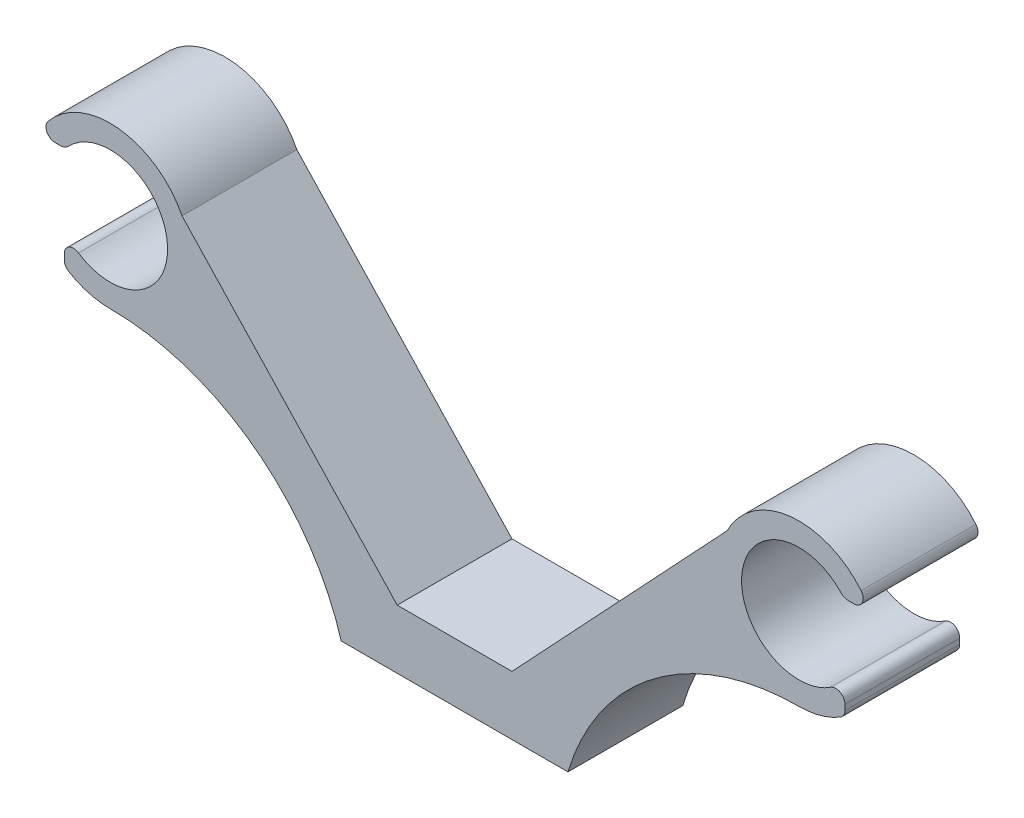
ISO-10303-21;
HEADER;
FILE_DESCRIPTION(('STEP AP214'),'2;1');
FILE_NAME('part.step','',(''),(''),'','','');
FILE_SCHEMA(('AUTOMOTIVE_DESIGN { 1 0 10303 214 1 1 1 1 }'));
ENDSEC;
DATA;
#1=APPLICATION_CONTEXT('core data for automotive mechanical design processes');
#2=APPLICATION_PROTOCOL_DEFINITION('international standard','automotive_design',2000,#1);
#3=PRODUCT_CONTEXT('',#1,'mechanical');
#4=PRODUCT('Part','Part','',(#3));
#5=PRODUCT_RELATED_PRODUCT_CATEGORY('part','',(#4));
#6=PRODUCT_DEFINITION_FORMATION('','',#4);
#7=PRODUCT_DEFINITION_CONTEXT('part definition',#1,'design');
#8=PRODUCT_DEFINITION('design','',#6,#7);
#9=PRODUCT_DEFINITION_SHAPE('','',#8);
#10=(LENGTH_UNIT() NAMED_UNIT(*) SI_UNIT(.MILLI.,.METRE.));
#11=(NAMED_UNIT(*) PLANE_ANGLE_UNIT() SI_UNIT($,.RADIAN.));
#12=(NAMED_UNIT(*) SI_UNIT($,.STERADIAN.) SOLID_ANGLE_UNIT());
#13=UNCERTAINTY_MEASURE_WITH_UNIT(LENGTH_MEASURE(1.E-05),#10,'distance_accuracy_value','');
#14=(GEOMETRIC_REPRESENTATION_CONTEXT(3) GLOBAL_UNCERTAINTY_ASSIGNED_CONTEXT((#13)) GLOBAL_UNIT_ASSIGNED_CONTEXT((#10,
#11,#12)) REPRESENTATION_CONTEXT('',''));
#15=CARTESIAN_POINT('',(0.,0.,0.));
#16=DIRECTION('',(0.,0.,1.));
#17=DIRECTION('',(1.,0.,0.));
#18=AXIS2_PLACEMENT_3D('',#15,#16,#17);
#19=CARTESIAN_POINT('',(-5.,5.14535993764462,10.));
#20=DIRECTION('',(-0.729515847590623,-0.683963908487966,0.));
#21=DIRECTION('',(0.683963908487966,-0.729515847590623,0.));
#22=AXIS2_PLACEMENT_3D('',#19,#20,#21);
#23=PLANE('',#22);
#24=DIRECTION('',(-0.683963908487966,0.729515847590623,0.));
#25=VECTOR('',#24,1.);
#26=CARTESIAN_POINT('',(-5.,5.14535993764462,0.));
#27=LINE('',#26,#25);
#28=CARTESIAN_POINT('',(-5.,5.14535993764462,0.));
#29=VERTEX_POINT('',#28);
#30=CARTESIAN_POINT('',(-23.7410390104122,25.1345505787621,0.));
#31=VERTEX_POINT('',#30);
#32=EDGE_CURVE('E225',#29,#31,#27,.T.);
#33=ORIENTED_EDGE('',*,*,#32,.T.);
#34=DIRECTION('',(0.,0.,-1.));
#35=VECTOR('',#34,1.);
#36=CARTESIAN_POINT('',(-23.7410390104122,25.1345505787621,10.));
#37=LINE('',#36,#35);
#38=CARTESIAN_POINT('',(-23.7410390104122,25.1345505787621,10.));
#39=VERTEX_POINT('',#38);
#40=EDGE_CURVE('E11',#39,#31,#37,.T.);
#41=ORIENTED_EDGE('',*,*,#40,.F.);
#42=DIRECTION('',(-0.683963908487966,0.729515847590623,0.));
#43=VECTOR('',#42,1.);
#44=CARTESIAN_POINT('',(-5.,5.14535993764462,10.));
#45=LINE('',#44,#43);
#46=CARTESIAN_POINT('',(-5.,5.14535993764462,10.));
#47=VERTEX_POINT('',#46);
#48=EDGE_CURVE('E271',#47,#39,#45,.T.);
#49=ORIENTED_EDGE('',*,*,#48,.F.);
#50=DIRECTION('',(0.,0.,-1.));
#51=VECTOR('',#50,1.);
#52=CARTESIAN_POINT('',(-5.,5.14535993764462,10.));
#53=LINE('',#52,#51);
#54=EDGE_CURVE('E221',#47,#29,#53,.T.);
#55=ORIENTED_EDGE('',*,*,#54,.T.);
#56=EDGE_LOOP('',(#33,#41,#49,#55));
#57=FACE_BOUND('',#56,.T.);
#58=ADVANCED_FACE('F33',(#57),#23,.F.);
#59=CARTESIAN_POINT('',(-30.,22.,10.));
#60=DIRECTION('',(0.,0.,-1.));
#61=DIRECTION('',(-1.,0.,0.));
#62=AXIS2_PLACEMENT_3D('',#59,#60,#61);
#63=CYLINDRICAL_SURFACE('',#62,7.);
#64=CARTESIAN_POINT('',(-30.,22.,0.));
#65=DIRECTION('',(0.,0.,1.));
#66=DIRECTION('',(1.,0.,0.));
#67=AXIS2_PLACEMENT_3D('',#64,#65,#66);
#68=CIRCLE('',#67,7.);
#69=CARTESIAN_POINT('',(-35.4098569694725,26.4422345244088,0.));
#70=VERTEX_POINT('',#69);
#71=EDGE_CURVE('E228',#31,#70,#68,.T.);
#72=ORIENTED_EDGE('',*,*,#71,.T.);
#73=DIRECTION('',(0.,0.,-1.));
#74=VECTOR('',#73,1.);
#75=CARTESIAN_POINT('',(-35.4098569694725,26.4422345244088,10.));
#76=LINE('',#75,#74);
#77=CARTESIAN_POINT('',(-35.4098569694725,26.4422345244088,10.));
#78=VERTEX_POINT('',#77);
#79=EDGE_CURVE('E41',#78,#70,#76,.T.);
#80=ORIENTED_EDGE('',*,*,#79,.F.);
#81=CARTESIAN_POINT('',(-30.,22.,10.));
#82=DIRECTION('',(0.,0.,1.));
#83=DIRECTION('',(1.,0.,0.));
#84=AXIS2_PLACEMENT_3D('',#81,#82,#83);
#85=CIRCLE('',#84,7.);
#86=EDGE_CURVE('E140',#39,#78,#85,.T.);
#87=ORIENTED_EDGE('',*,*,#86,.F.);
#88=ORIENTED_EDGE('',*,*,#40,.T.);
#89=EDGE_LOOP('',(#72,#80,#87,#88));
#90=FACE_BOUND('',#89,.T.);
#91=ADVANCED_FACE('F409',(#90),#63,.T.);
#92=CARTESIAN_POINT('',(-34.7915876015328,25.9345505787621,10.));
#93=DIRECTION('',(0.,0.,-1.));
#94=DIRECTION('',(-1.,0.,0.));
#95=AXIS2_PLACEMENT_3D('',#92,#93,#94);
#96=CYLINDRICAL_SURFACE('',#95,0.800000000000001);
#97=CARTESIAN_POINT('',(-34.7915876015328,25.9345505787621,0.));
#98=DIRECTION('',(0.,0.,1.));
#99=DIRECTION('',(-1.,0.,0.));
#100=AXIS2_PLACEMENT_3D('',#97,#98,#99);
#101=CIRCLE('',#100,0.800000000000001);
#102=CARTESIAN_POINT('',(-34.7915876015328,25.1345505787621,0.));
#103=VERTEX_POINT('',#102);
#104=EDGE_CURVE('E230',#70,#103,#101,.T.);
#105=ORIENTED_EDGE('',*,*,#104,.T.);
#106=DIRECTION('',(0.,0.,-1.));
#107=VECTOR('',#106,1.);
#108=CARTESIAN_POINT('',(-34.7915876015328,25.1345505787621,10.));
#109=LINE('',#108,#107);
#110=CARTESIAN_POINT('',(-34.7915876015328,25.1345505787621,10.));
#111=VERTEX_POINT('',#110);
#112=EDGE_CURVE('E326',#111,#103,#109,.T.);
#113=ORIENTED_EDGE('',*,*,#112,.F.);
#114=CARTESIAN_POINT('',(-34.7915876015328,25.9345505787621,10.));
#115=DIRECTION('',(0.,0.,1.));
#116=DIRECTION('',(-1.,0.,0.));
#117=AXIS2_PLACEMENT_3D('',#114,#115,#116);
#118=CIRCLE('',#117,0.800000000000001);
#119=EDGE_CURVE('E334',#78,#111,#118,.T.);
#120=ORIENTED_EDGE('',*,*,#119,.F.);
#121=ORIENTED_EDGE('',*,*,#79,.T.);
#122=EDGE_LOOP('',(#105,#113,#120,#121));
#123=FACE_BOUND('',#122,.T.);
#124=ADVANCED_FACE('F332',(#123),#96,.T.);
#125=CARTESIAN_POINT('',(-34.3480445618298,25.1345505787621,10.));
#126=DIRECTION('',(0.,1.,0.));
#127=DIRECTION('',(-1.,0.,0.));
#128=AXIS2_PLACEMENT_3D('',#125,#126,#127);
#129=PLANE('',#128);
#130=DIRECTION('',(1.,0.,0.));
#131=VECTOR('',#130,1.);
#132=CARTESIAN_POINT('',(-34.3480445618298,25.1345505787621,0.));
#133=LINE('',#132,#131);
#134=CARTESIAN_POINT('',(-34.3480445618298,25.1345505787621,0.));
#135=VERTEX_POINT('',#134);
#136=EDGE_CURVE('E232',#103,#135,#133,.T.);
#137=ORIENTED_EDGE('',*,*,#136,.T.);
#138=DIRECTION('',(0.,0.,-1.));
#139=VECTOR('',#138,1.);
#140=CARTESIAN_POINT('',(-34.3480445618298,25.1345505787621,10.));
#141=LINE('',#140,#139);
#142=CARTESIAN_POINT('',(-34.3480445618298,25.1345505787621,10.));
#143=VERTEX_POINT('',#142);
#144=EDGE_CURVE('E323',#143,#135,#141,.T.);
#145=ORIENTED_EDGE('',*,*,#144,.F.);
#146=DIRECTION('',(1.,0.,0.));
#147=VECTOR('',#146,1.);
#148=CARTESIAN_POINT('',(-34.3480445618298,25.1345505787621,10.));
#149=LINE('',#148,#147);
#150=EDGE_CURVE('E352',#111,#143,#149,.T.);
#151=ORIENTED_EDGE('',*,*,#150,.F.);
#152=ORIENTED_EDGE('',*,*,#112,.T.);
#153=EDGE_LOOP('',(#137,#145,#151,#152));
#154=FACE_BOUND('',#153,.T.);
#155=ADVANCED_FACE('F343',(#154),#129,.F.);
#156=CARTESIAN_POINT('',(-34.3480445618298,26.1345505787621,10.));
#157=DIRECTION('',(0.,0.,-1.));
#158=DIRECTION('',(-1.,0.,0.));
#159=AXIS2_PLACEMENT_3D('',#156,#157,#158);
#160=CYLINDRICAL_SURFACE('',#159,1.);
#161=CARTESIAN_POINT('',(-34.3480445618298,26.1345505787621,0.));
#162=DIRECTION('',(0.,0.,1.));
#163=DIRECTION('',(1.,0.,0.));
#164=AXIS2_PLACEMENT_3D('',#161,#162,#163);
#165=CIRCLE('',#164,1.);
#166=CARTESIAN_POINT('',(-33.6233704681915,25.4454588156351,0.));
#167=VERTEX_POINT('',#166);
#168=EDGE_CURVE('E234',#135,#167,#165,.T.);
#169=ORIENTED_EDGE('',*,*,#168,.T.);
#170=DIRECTION('',(0.,0.,-1.));
#171=VECTOR('',#170,1.);
#172=CARTESIAN_POINT('',(-33.6233704681915,25.4454588156351,10.));
#173=LINE('',#172,#171);
#174=CARTESIAN_POINT('',(-33.6233704681915,25.4454588156351,10.));
#175=VERTEX_POINT('',#174);
#176=EDGE_CURVE('E320',#175,#167,#173,.T.);
#177=ORIENTED_EDGE('',*,*,#176,.F.);
#178=CARTESIAN_POINT('',(-34.3480445618298,26.1345505787621,10.));
#179=DIRECTION('',(0.,0.,1.));
#180=DIRECTION('',(1.,0.,0.));
#181=AXIS2_PLACEMENT_3D('',#178,#179,#180);
#182=CIRCLE('',#181,1.);
#183=EDGE_CURVE('E349',#143,#175,#182,.T.);
#184=ORIENTED_EDGE('',*,*,#183,.F.);
#185=ORIENTED_EDGE('',*,*,#144,.T.);
#186=EDGE_LOOP('',(#169,#177,#184,#185));
#187=FACE_BOUND('',#186,.T.);
#188=ADVANCED_FACE('F347',(#187),#160,.T.);
#189=CARTESIAN_POINT('',(-30.,22.,10.));
#190=DIRECTION('',(0.,0.,-1.));
#191=DIRECTION('',(-1.,0.,0.));
#192=AXIS2_PLACEMENT_3D('',#189,#190,#191);
#193=CYLINDRICAL_SURFACE('',#192,5.);
#194=CARTESIAN_POINT('',(-30.,22.,0.));
#195=DIRECTION('',(0.,0.,-1.));
#196=DIRECTION('',(1.,0.,0.));
#197=AXIS2_PLACEMENT_3D('',#194,#195,#196);
#198=CIRCLE('',#197,5.);
#199=CARTESIAN_POINT('',(-32.7586206896552,17.8298666819145,0.));
#200=VERTEX_POINT('',#199);
#201=EDGE_CURVE('E236',#167,#200,#198,.T.);
#202=ORIENTED_EDGE('',*,*,#201,.T.);
#203=DIRECTION('',(0.,0.,-1.));
#204=VECTOR('',#203,1.);
#205=CARTESIAN_POINT('',(-32.7586206896552,17.8298666819145,10.));
#206=LINE('',#205,#204);
#207=CARTESIAN_POINT('',(-32.7586206896552,17.8298666819145,10.));
#208=VERTEX_POINT('',#207);
#209=EDGE_CURVE('E317',#208,#200,#206,.T.);
#210=ORIENTED_EDGE('',*,*,#209,.F.);
#211=CARTESIAN_POINT('',(-30.,22.,10.));
#212=DIRECTION('',(0.,0.,-1.));
#213=DIRECTION('',(1.,0.,0.));
#214=AXIS2_PLACEMENT_3D('',#211,#212,#213);
#215=CIRCLE('',#214,5.);
#216=EDGE_CURVE('E351',#175,#208,#215,.T.);
#217=ORIENTED_EDGE('',*,*,#216,.F.);
#218=ORIENTED_EDGE('',*,*,#176,.T.);
#219=EDGE_LOOP('',(#202,#210,#217,#218));
#220=FACE_BOUND('',#219,.T.);
#221=ADVANCED_FACE('F422',(#220),#193,.F.);
#222=CARTESIAN_POINT('',(-33.2,17.1626453510209,10.));
#223=DIRECTION('',(0.,0.,-1.));
#224=DIRECTION('',(-1.,0.,0.));
#225=AXIS2_PLACEMENT_3D('',#222,#223,#224);
#226=CYLINDRICAL_SURFACE('',#225,0.8);
#227=CARTESIAN_POINT('',(-33.2,17.1626453510209,0.));
#228=DIRECTION('',(0.,0.,1.));
#229=DIRECTION('',(-1.,0.,0.));
#230=AXIS2_PLACEMENT_3D('',#227,#228,#229);
#231=CIRCLE('',#230,0.8);
#232=CARTESIAN_POINT('',(-34.,17.1626453510209,0.));
#233=VERTEX_POINT('',#232);
#234=EDGE_CURVE('E238',#200,#233,#231,.T.);
#235=ORIENTED_EDGE('',*,*,#234,.T.);
#236=DIRECTION('',(0.,0.,-1.));
#237=VECTOR('',#236,1.);
#238=CARTESIAN_POINT('',(-34.,17.1626453510209,10.));
#239=LINE('',#238,#237);
#240=CARTESIAN_POINT('',(-34.,17.1626453510209,10.));
#241=VERTEX_POINT('',#240);
#242=EDGE_CURVE('E314',#241,#233,#239,.T.);
#243=ORIENTED_EDGE('',*,*,#242,.F.);
#244=CARTESIAN_POINT('',(-33.2,17.1626453510209,10.));
#245=DIRECTION('',(0.,0.,1.));
#246=DIRECTION('',(-1.,0.,0.));
#247=AXIS2_PLACEMENT_3D('',#244,#245,#246);
#248=CIRCLE('',#247,0.8);
#249=EDGE_CURVE('E354',#208,#241,#248,.T.);
#250=ORIENTED_EDGE('',*,*,#249,.F.);
#251=ORIENTED_EDGE('',*,*,#209,.T.);
#252=EDGE_LOOP('',(#235,#243,#250,#251));
#253=FACE_BOUND('',#252,.T.);
#254=ADVANCED_FACE('F425',(#253),#226,.T.);
#255=CARTESIAN_POINT('',(-34.,16.6896327810593,10.));
#256=DIRECTION('',(1.,0.,0.));
#257=DIRECTION('',(0.,0.,-1.));
#258=AXIS2_PLACEMENT_3D('',#255,#256,#257);
#259=PLANE('',#258);
#260=DIRECTION('',(0.,-1.,0.));
#261=VECTOR('',#260,1.);
#262=CARTESIAN_POINT('',(-34.,16.6896327810593,0.));
#263=LINE('',#262,#261);
#264=CARTESIAN_POINT('',(-34.,16.6896327810593,0.));
#265=VERTEX_POINT('',#264);
#266=EDGE_CURVE('E240',#233,#265,#263,.T.);
#267=ORIENTED_EDGE('',*,*,#266,.T.);
#268=DIRECTION('',(0.,0.,-1.));
#269=VECTOR('',#268,1.);
#270=CARTESIAN_POINT('',(-34.,16.6896327810593,10.));
#271=LINE('',#270,#269);
#272=CARTESIAN_POINT('',(-34.,16.6896327810593,10.));
#273=VERTEX_POINT('',#272);
#274=EDGE_CURVE('E311',#273,#265,#271,.T.);
#275=ORIENTED_EDGE('',*,*,#274,.F.);
#276=DIRECTION('',(0.,-1.,0.));
#277=VECTOR('',#276,1.);
#278=CARTESIAN_POINT('',(-34.,16.6896327810593,10.));
#279=LINE('',#278,#277);
#280=EDGE_CURVE('E360',#241,#273,#279,.T.);
#281=ORIENTED_EDGE('',*,*,#280,.F.);
#282=ORIENTED_EDGE('',*,*,#242,.T.);
#283=EDGE_LOOP('',(#267,#275,#281,#282));
#284=FACE_BOUND('',#283,.T.);
#285=ADVANCED_FACE('F429',(#284),#259,.F.);
#286=CARTESIAN_POINT('',(-33.2,16.6896327810593,10.));
#287=DIRECTION('',(0.,0.,-1.));
#288=DIRECTION('',(-1.,0.,0.));
#289=AXIS2_PLACEMENT_3D('',#286,#287,#288);
#290=CYLINDRICAL_SURFACE('',#289,0.800000000000003);
#291=CARTESIAN_POINT('',(-33.2,16.6896327810593,0.));
#292=DIRECTION('',(0.,0.,1.));
#293=DIRECTION('',(1.,0.,0.));
#294=AXIS2_PLACEMENT_3D('',#291,#292,#293);
#295=CIRCLE('',#294,0.800000000000003);
#296=CARTESIAN_POINT('',(-33.6129032258065,16.0044241076476,0.));
#297=VERTEX_POINT('',#296);
#298=EDGE_CURVE('E242',#265,#297,#295,.T.);
#299=ORIENTED_EDGE('',*,*,#298,.T.);
#300=DIRECTION('',(0.,0.,-1.));
#301=VECTOR('',#300,1.);
#302=CARTESIAN_POINT('',(-33.6129032258065,16.0044241076476,10.));
#303=LINE('',#302,#301);
#304=CARTESIAN_POINT('',(-33.6129032258065,16.0044241076476,10.));
#305=VERTEX_POINT('',#304);
#306=EDGE_CURVE('E308',#305,#297,#303,.T.);
#307=ORIENTED_EDGE('',*,*,#306,.F.);
#308=CARTESIAN_POINT('',(-33.2,16.6896327810593,10.));
#309=DIRECTION('',(0.,0.,1.));
#310=DIRECTION('',(1.,0.,0.));
#311=AXIS2_PLACEMENT_3D('',#308,#309,#310);
#312=CIRCLE('',#311,0.800000000000003);
#313=EDGE_CURVE('E362',#273,#305,#312,.T.);
#314=ORIENTED_EDGE('',*,*,#313,.F.);
#315=ORIENTED_EDGE('',*,*,#274,.T.);
#316=EDGE_LOOP('',(#299,#307,#314,#315));
#317=FACE_BOUND('',#316,.T.);
#318=ADVANCED_FACE('F433',(#317),#290,.T.);
#319=CARTESIAN_POINT('',(-30.,22.,10.));
#320=DIRECTION('',(0.,0.,-1.));
#321=DIRECTION('',(-1.,0.,0.));
#322=AXIS2_PLACEMENT_3D('',#319,#320,#321);
#323=CYLINDRICAL_SURFACE('',#322,7.);
#324=CARTESIAN_POINT('',(-30.,22.,0.));
#325=DIRECTION('',(0.,0.,1.));
#326=DIRECTION('',(1.,0.,0.));
#327=AXIS2_PLACEMENT_3D('',#324,#325,#326);
#328=CIRCLE('',#327,7.);
#329=CARTESIAN_POINT('',(-30.,15.,0.));
#330=VERTEX_POINT('',#329);
#331=EDGE_CURVE('E244',#297,#330,#328,.T.);
#332=ORIENTED_EDGE('',*,*,#331,.T.);
#333=DIRECTION('',(0.,0.,-1.));
#334=VECTOR('',#333,1.);
#335=CARTESIAN_POINT('',(-30.,15.,10.));
#336=LINE('',#335,#334);
#337=CARTESIAN_POINT('',(-30.,15.,10.));
#338=VERTEX_POINT('',#337);
#339=EDGE_CURVE('E305',#338,#330,#336,.T.);
#340=ORIENTED_EDGE('',*,*,#339,.F.);
#341=CARTESIAN_POINT('',(-30.,22.,10.));
#342=DIRECTION('',(0.,0.,1.));
#343=DIRECTION('',(1.,0.,0.));
#344=AXIS2_PLACEMENT_3D('',#341,#342,#343);
#345=CIRCLE('',#344,7.);
#346=EDGE_CURVE('E364',#305,#338,#345,.T.);
#347=ORIENTED_EDGE('',*,*,#346,.F.);
#348=ORIENTED_EDGE('',*,*,#306,.T.);
#349=EDGE_LOOP('',(#332,#340,#347,#348));
#350=FACE_BOUND('',#349,.T.);
#351=ADVANCED_FACE('F437',(#350),#323,.T.);
#352=CARTESIAN_POINT('',(-30.,-6.,10.));
#353=DIRECTION('',(0.,0.,-1.));
#354=DIRECTION('',(-1.,0.,0.));
#355=AXIS2_PLACEMENT_3D('',#352,#353,#354);
#356=CYLINDRICAL_SURFACE('',#355,21.);
#357=CARTESIAN_POINT('',(-30.,-6.,0.));
#358=DIRECTION('',(0.,0.,-1.));
#359=DIRECTION('',(1.,0.,0.));
#360=AXIS2_PLACEMENT_3D('',#357,#358,#359);
#361=CIRCLE('',#360,21.);
#362=CARTESIAN_POINT('',(-9.87538820250189,0.,0.));
#363=VERTEX_POINT('',#362);
#364=EDGE_CURVE('E246',#330,#363,#361,.T.);
#365=ORIENTED_EDGE('',*,*,#364,.T.);
#366=DIRECTION('',(0.,0.,-1.));
#367=VECTOR('',#366,1.);
#368=CARTESIAN_POINT('',(-9.87538820250189,0.,10.));
#369=LINE('',#368,#367);
#370=CARTESIAN_POINT('',(-9.87538820250189,0.,10.));
#371=VERTEX_POINT('',#370);
#372=EDGE_CURVE('E302',#371,#363,#369,.T.);
#373=ORIENTED_EDGE('',*,*,#372,.F.);
#374=CARTESIAN_POINT('',(-30.,-6.,10.));
#375=DIRECTION('',(0.,0.,-1.));
#376=DIRECTION('',(1.,0.,0.));
#377=AXIS2_PLACEMENT_3D('',#374,#375,#376);
#378=CIRCLE('',#377,21.);
#379=EDGE_CURVE('E366',#338,#371,#378,.T.);
#380=ORIENTED_EDGE('',*,*,#379,.F.);
#381=ORIENTED_EDGE('',*,*,#339,.T.);
#382=EDGE_LOOP('',(#365,#373,#380,#381));
#383=FACE_BOUND('',#382,.T.);
#384=ADVANCED_FACE('F441',(#383),#356,.F.);
#385=CARTESIAN_POINT('',(9.87538820250189,0.,10.));
#386=DIRECTION('',(0.,1.,0.));
#387=DIRECTION('',(0.,0.,1.));
#388=AXIS2_PLACEMENT_3D('',#385,#386,#387);
#389=PLANE('',#388);
#390=DIRECTION('',(1.,0.,0.));
#391=VECTOR('',#390,1.);
#392=CARTESIAN_POINT('',(9.87538820250189,0.,0.));
#393=LINE('',#392,#391);
#394=CARTESIAN_POINT('',(9.87538820250189,0.,0.));
#395=VERTEX_POINT('',#394);
#396=EDGE_CURVE('E248',#363,#395,#393,.T.);
#397=ORIENTED_EDGE('',*,*,#396,.T.);
#398=DIRECTION('',(0.,0.,-1.));
#399=VECTOR('',#398,1.);
#400=CARTESIAN_POINT('',(9.87538820250189,0.,10.));
#401=LINE('',#400,#399);
#402=CARTESIAN_POINT('',(9.87538820250189,0.,10.));
#403=VERTEX_POINT('',#402);
#404=EDGE_CURVE('E299',#403,#395,#401,.T.);
#405=ORIENTED_EDGE('',*,*,#404,.F.);
#406=DIRECTION('',(1.,0.,0.));
#407=VECTOR('',#406,1.);
#408=CARTESIAN_POINT('',(9.87538820250189,0.,10.));
#409=LINE('',#408,#407);
#410=EDGE_CURVE('E368',#371,#403,#409,.T.);
#411=ORIENTED_EDGE('',*,*,#410,.F.);
#412=ORIENTED_EDGE('',*,*,#372,.T.);
#413=EDGE_LOOP('',(#397,#405,#411,#412));
#414=FACE_BOUND('',#413,.T.);
#415=ADVANCED_FACE('F445',(#414),#389,.F.);
#416=CARTESIAN_POINT('',(30.,-6.,10.));
#417=DIRECTION('',(0.,0.,-1.));
#418=DIRECTION('',(-1.,0.,0.));
#419=AXIS2_PLACEMENT_3D('',#416,#417,#418);
#420=CYLINDRICAL_SURFACE('',#419,21.);
#421=CARTESIAN_POINT('',(30.,-6.,0.));
#422=DIRECTION('',(0.,0.,-1.));
#423=DIRECTION('',(-1.,0.,0.));
#424=AXIS2_PLACEMENT_3D('',#421,#422,#423);
#425=CIRCLE('',#424,21.);
#426=CARTESIAN_POINT('',(30.,15.,0.));
#427=VERTEX_POINT('',#426);
#428=EDGE_CURVE('E250',#395,#427,#425,.T.);
#429=ORIENTED_EDGE('',*,*,#428,.T.);
#430=DIRECTION('',(0.,0.,-1.));
#431=VECTOR('',#430,1.);
#432=CARTESIAN_POINT('',(30.,15.,10.));
#433=LINE('',#432,#431);
#434=CARTESIAN_POINT('',(30.,15.,10.));
#435=VERTEX_POINT('',#434);
#436=EDGE_CURVE('E296',#435,#427,#433,.T.);
#437=ORIENTED_EDGE('',*,*,#436,.F.);
#438=CARTESIAN_POINT('',(30.,-6.,10.));
#439=DIRECTION('',(0.,0.,-1.));
#440=DIRECTION('',(-1.,0.,0.));
#441=AXIS2_PLACEMENT_3D('',#438,#439,#440);
#442=CIRCLE('',#441,21.);
#443=EDGE_CURVE('E370',#403,#435,#442,.T.);
#444=ORIENTED_EDGE('',*,*,#443,.F.);
#445=ORIENTED_EDGE('',*,*,#404,.T.);
#446=EDGE_LOOP('',(#429,#437,#444,#445));
#447=FACE_BOUND('',#446,.T.);
#448=ADVANCED_FACE('F449',(#447),#420,.F.);
#449=CARTESIAN_POINT('',(30.,22.,10.));
#450=DIRECTION('',(0.,0.,-1.));
#451=DIRECTION('',(-1.,0.,0.));
#452=AXIS2_PLACEMENT_3D('',#449,#450,#451);
#453=CYLINDRICAL_SURFACE('',#452,7.);
#454=CARTESIAN_POINT('',(30.,22.,0.));
#455=DIRECTION('',(0.,0.,1.));
#456=DIRECTION('',(-1.,0.,0.));
#457=AXIS2_PLACEMENT_3D('',#454,#455,#456);
#458=CIRCLE('',#457,7.);
#459=CARTESIAN_POINT('',(33.6129032258065,16.0044241076476,0.));
#460=VERTEX_POINT('',#459);
#461=EDGE_CURVE('E252',#427,#460,#458,.T.);
#462=ORIENTED_EDGE('',*,*,#461,.T.);
#463=DIRECTION('',(0.,0.,-1.));
#464=VECTOR('',#463,1.);
#465=CARTESIAN_POINT('',(33.6129032258065,16.0044241076476,10.));
#466=LINE('',#465,#464);
#467=CARTESIAN_POINT('',(33.6129032258065,16.0044241076476,10.));
#468=VERTEX_POINT('',#467);
#469=EDGE_CURVE('E293',#468,#460,#466,.T.);
#470=ORIENTED_EDGE('',*,*,#469,.F.);
#471=CARTESIAN_POINT('',(30.,22.,10.));
#472=DIRECTION('',(0.,0.,1.));
#473=DIRECTION('',(-1.,0.,0.));
#474=AXIS2_PLACEMENT_3D('',#471,#472,#473);
#475=CIRCLE('',#474,7.);
#476=EDGE_CURVE('E372',#435,#468,#475,.T.);
#477=ORIENTED_EDGE('',*,*,#476,.F.);
#478=ORIENTED_EDGE('',*,*,#436,.T.);
#479=EDGE_LOOP('',(#462,#470,#477,#478));
#480=FACE_BOUND('',#479,.T.);
#481=ADVANCED_FACE('F453',(#480),#453,.T.);
#482=CARTESIAN_POINT('',(33.2,16.6896327810593,10.));
#483=DIRECTION('',(0.,0.,-1.));
#484=DIRECTION('',(-1.,0.,0.));
#485=AXIS2_PLACEMENT_3D('',#482,#483,#484);
#486=CYLINDRICAL_SURFACE('',#485,0.800000000000003);
#487=CARTESIAN_POINT('',(33.2,16.6896327810593,0.));
#488=DIRECTION('',(0.,0.,1.));
#489=DIRECTION('',(-1.,0.,0.));
#490=AXIS2_PLACEMENT_3D('',#487,#488,#489);
#491=CIRCLE('',#490,0.800000000000003);
#492=CARTESIAN_POINT('',(34.,16.6896327810593,0.));
#493=VERTEX_POINT('',#492);
#494=EDGE_CURVE('E254',#460,#493,#491,.T.);
#495=ORIENTED_EDGE('',*,*,#494,.T.);
#496=DIRECTION('',(0.,0.,-1.));
#497=VECTOR('',#496,1.);
#498=CARTESIAN_POINT('',(34.,16.6896327810593,10.));
#499=LINE('',#498,#497);
#500=CARTESIAN_POINT('',(34.,16.6896327810593,10.));
#501=VERTEX_POINT('',#500);
#502=EDGE_CURVE('E290',#501,#493,#499,.T.);
#503=ORIENTED_EDGE('',*,*,#502,.F.);
#504=CARTESIAN_POINT('',(33.2,16.6896327810593,10.));
#505=DIRECTION('',(0.,0.,1.));
#506=DIRECTION('',(-1.,0.,0.));
#507=AXIS2_PLACEMENT_3D('',#504,#505,#506);
#508=CIRCLE('',#507,0.800000000000003);
#509=EDGE_CURVE('E374',#468,#501,#508,.T.);
#510=ORIENTED_EDGE('',*,*,#509,.F.);
#511=ORIENTED_EDGE('',*,*,#469,.T.);
#512=EDGE_LOOP('',(#495,#503,#510,#511));
#513=FACE_BOUND('',#512,.T.);
#514=ADVANCED_FACE('F457',(#513),#486,.T.);
#515=CARTESIAN_POINT('',(34.,16.6896327810593,10.));
#516=DIRECTION('',(-1.,0.,0.));
#517=DIRECTION('',(0.,0.,1.));
#518=AXIS2_PLACEMENT_3D('',#515,#516,#517);
#519=PLANE('',#518);
#520=DIRECTION('',(0.,1.,0.));
#521=VECTOR('',#520,1.);
#522=CARTESIAN_POINT('',(34.,16.6896327810593,0.));
#523=LINE('',#522,#521);
#524=CARTESIAN_POINT('',(34.,17.1626453510209,0.));
#525=VERTEX_POINT('',#524);
#526=EDGE_CURVE('E256',#493,#525,#523,.T.);
#527=ORIENTED_EDGE('',*,*,#526,.T.);
#528=DIRECTION('',(0.,0.,-1.));
#529=VECTOR('',#528,1.);
#530=CARTESIAN_POINT('',(34.,17.1626453510209,10.));
#531=LINE('',#530,#529);
#532=CARTESIAN_POINT('',(34.,17.1626453510209,10.));
#533=VERTEX_POINT('',#532);
#534=EDGE_CURVE('E287',#533,#525,#531,.T.);
#535=ORIENTED_EDGE('',*,*,#534,.F.);
#536=DIRECTION('',(0.,1.,0.));
#537=VECTOR('',#536,1.);
#538=CARTESIAN_POINT('',(34.,16.6896327810593,10.));
#539=LINE('',#538,#537);
#540=EDGE_CURVE('E376',#501,#533,#539,.T.);
#541=ORIENTED_EDGE('',*,*,#540,.F.);
#542=ORIENTED_EDGE('',*,*,#502,.T.);
#543=EDGE_LOOP('',(#527,#535,#541,#542));
#544=FACE_BOUND('',#543,.T.);
#545=ADVANCED_FACE('F461',(#544),#519,.F.);
#546=CARTESIAN_POINT('',(33.2,17.1626453510209,10.));
#547=DIRECTION('',(0.,0.,-1.));
#548=DIRECTION('',(-1.,0.,0.));
#549=AXIS2_PLACEMENT_3D('',#546,#547,#548);
#550=CYLINDRICAL_SURFACE('',#549,0.8);
#551=CARTESIAN_POINT('',(33.2,17.1626453510209,0.));
#552=DIRECTION('',(0.,0.,1.));
#553=DIRECTION('',(1.,0.,0.));
#554=AXIS2_PLACEMENT_3D('',#551,#552,#553);
#555=CIRCLE('',#554,0.8);
#556=CARTESIAN_POINT('',(32.7586206896552,17.8298666819145,0.));
#557=VERTEX_POINT('',#556);
#558=EDGE_CURVE('E258',#525,#557,#555,.T.);
#559=ORIENTED_EDGE('',*,*,#558,.T.);
#560=DIRECTION('',(0.,0.,-1.));
#561=VECTOR('',#560,1.);
#562=CARTESIAN_POINT('',(32.7586206896552,17.8298666819145,10.));
#563=LINE('',#562,#561);
#564=CARTESIAN_POINT('',(32.7586206896552,17.8298666819145,10.));
#565=VERTEX_POINT('',#564);
#566=EDGE_CURVE('E284',#565,#557,#563,.T.);
#567=ORIENTED_EDGE('',*,*,#566,.F.);
#568=CARTESIAN_POINT('',(33.2,17.1626453510209,10.));
#569=DIRECTION('',(0.,0.,1.));
#570=DIRECTION('',(1.,0.,0.));
#571=AXIS2_PLACEMENT_3D('',#568,#569,#570);
#572=CIRCLE('',#571,0.8);
#573=EDGE_CURVE('E378',#533,#565,#572,.T.);
#574=ORIENTED_EDGE('',*,*,#573,.F.);
#575=ORIENTED_EDGE('',*,*,#534,.T.);
#576=EDGE_LOOP('',(#559,#567,#574,#575));
#577=FACE_BOUND('',#576,.T.);
#578=ADVANCED_FACE('F465',(#577),#550,.T.);
#579=CARTESIAN_POINT('',(30.,22.,10.));
#580=DIRECTION('',(0.,0.,-1.));
#581=DIRECTION('',(-1.,0.,0.));
#582=AXIS2_PLACEMENT_3D('',#579,#580,#581);
#583=CYLINDRICAL_SURFACE('',#582,5.);
#584=CARTESIAN_POINT('',(30.,22.,0.));
#585=DIRECTION('',(0.,0.,-1.));
#586=DIRECTION('',(-1.,0.,0.));
#587=AXIS2_PLACEMENT_3D('',#584,#585,#586);
#588=CIRCLE('',#587,5.);
#589=CARTESIAN_POINT('',(33.6233704681915,25.4454588156351,0.));
#590=VERTEX_POINT('',#589);
#591=EDGE_CURVE('E260',#557,#590,#588,.T.);
#592=ORIENTED_EDGE('',*,*,#591,.T.);
#593=DIRECTION('',(0.,0.,-1.));
#594=VECTOR('',#593,1.);
#595=CARTESIAN_POINT('',(33.6233704681915,25.4454588156351,10.));
#596=LINE('',#595,#594);
#597=CARTESIAN_POINT('',(33.6233704681915,25.4454588156351,10.));
#598=VERTEX_POINT('',#597);
#599=EDGE_CURVE('E281',#598,#590,#596,.T.);
#600=ORIENTED_EDGE('',*,*,#599,.F.);
#601=CARTESIAN_POINT('',(30.,22.,10.));
#602=DIRECTION('',(0.,0.,-1.));
#603=DIRECTION('',(-1.,0.,0.));
#604=AXIS2_PLACEMENT_3D('',#601,#602,#603);
#605=CIRCLE('',#604,5.);
#606=EDGE_CURVE('E380',#565,#598,#605,.T.);
#607=ORIENTED_EDGE('',*,*,#606,.F.);
#608=ORIENTED_EDGE('',*,*,#566,.T.);
#609=EDGE_LOOP('',(#592,#600,#607,#608));
#610=FACE_BOUND('',#609,.T.);
#611=ADVANCED_FACE('F469',(#610),#583,.F.);
#612=CARTESIAN_POINT('',(34.3480445618298,26.1345505787621,10.));
#613=DIRECTION('',(0.,0.,-1.));
#614=DIRECTION('',(-1.,0.,0.));
#615=AXIS2_PLACEMENT_3D('',#612,#613,#614);
#616=CYLINDRICAL_SURFACE('',#615,1.);
#617=CARTESIAN_POINT('',(34.3480445618298,26.1345505787621,0.));
#618=DIRECTION('',(0.,0.,1.));
#619=DIRECTION('',(-1.,0.,0.));
#620=AXIS2_PLACEMENT_3D('',#617,#618,#619);
#621=CIRCLE('',#620,1.);
#622=CARTESIAN_POINT('',(34.3480445618298,25.1345505787621,0.));
#623=VERTEX_POINT('',#622);
#624=EDGE_CURVE('E262',#590,#623,#621,.T.);
#625=ORIENTED_EDGE('',*,*,#624,.T.);
#626=DIRECTION('',(0.,0.,-1.));
#627=VECTOR('',#626,1.);
#628=CARTESIAN_POINT('',(34.3480445618298,25.1345505787621,10.));
#629=LINE('',#628,#627);
#630=CARTESIAN_POINT('',(34.3480445618298,25.1345505787621,10.));
#631=VERTEX_POINT('',#630);
#632=EDGE_CURVE('E278',#631,#623,#629,.T.);
#633=ORIENTED_EDGE('',*,*,#632,.F.);
#634=CARTESIAN_POINT('',(34.3480445618298,26.1345505787621,10.));
#635=DIRECTION('',(0.,0.,1.));
#636=DIRECTION('',(-1.,0.,0.));
#637=AXIS2_PLACEMENT_3D('',#634,#635,#636);
#638=CIRCLE('',#637,1.);
#639=EDGE_CURVE('E382',#598,#631,#638,.T.);
#640=ORIENTED_EDGE('',*,*,#639,.F.);
#641=ORIENTED_EDGE('',*,*,#599,.T.);
#642=EDGE_LOOP('',(#625,#633,#640,#641));
#643=FACE_BOUND('',#642,.T.);
#644=ADVANCED_FACE('F473',(#643),#616,.T.);
#645=CARTESIAN_POINT('',(34.3480445618298,25.1345505787621,10.));
#646=DIRECTION('',(0.,1.,0.));
#647=DIRECTION('',(-1.,0.,0.));
#648=AXIS2_PLACEMENT_3D('',#645,#646,#647);
#649=PLANE('',#648);
#650=DIRECTION('',(1.,0.,0.));
#651=VECTOR('',#650,1.);
#652=CARTESIAN_POINT('',(34.3480445618298,25.1345505787621,0.));
#653=LINE('',#652,#651);
#654=CARTESIAN_POINT('',(34.7915876015328,25.1345505787621,0.));
#655=VERTEX_POINT('',#654);
#656=EDGE_CURVE('E264',#623,#655,#653,.T.);
#657=ORIENTED_EDGE('',*,*,#656,.T.);
#658=DIRECTION('',(0.,0.,-1.));
#659=VECTOR('',#658,1.);
#660=CARTESIAN_POINT('',(34.7915876015328,25.1345505787621,10.));
#661=LINE('',#660,#659);
#662=CARTESIAN_POINT('',(34.7915876015328,25.1345505787621,10.));
#663=VERTEX_POINT('',#662);
#664=EDGE_CURVE('E275',#663,#655,#661,.T.);
#665=ORIENTED_EDGE('',*,*,#664,.F.);
#666=DIRECTION('',(1.,0.,0.));
#667=VECTOR('',#666,1.);
#668=CARTESIAN_POINT('',(34.3480445618298,25.1345505787621,10.));
#669=LINE('',#668,#667);
#670=EDGE_CURVE('E384',#631,#663,#669,.T.);
#671=ORIENTED_EDGE('',*,*,#670,.F.);
#672=ORIENTED_EDGE('',*,*,#632,.T.);
#673=EDGE_LOOP('',(#657,#665,#671,#672));
#674=FACE_BOUND('',#673,.T.);
#675=ADVANCED_FACE('F390',(#674),#649,.F.);
#676=CARTESIAN_POINT('',(34.7915876015328,25.9345505787621,10.));
#677=DIRECTION('',(0.,0.,-1.));
#678=DIRECTION('',(-1.,0.,0.));
#679=AXIS2_PLACEMENT_3D('',#676,#677,#678);
#680=CYLINDRICAL_SURFACE('',#679,0.800000000000001);
#681=CARTESIAN_POINT('',(34.7915876015328,25.9345505787621,0.));
#682=DIRECTION('',(0.,0.,1.));
#683=DIRECTION('',(1.,0.,0.));
#684=AXIS2_PLACEMENT_3D('',#681,#682,#683);
#685=CIRCLE('',#684,0.800000000000001);
#686=CARTESIAN_POINT('',(35.4098569694725,26.4422345244088,0.));
#687=VERTEX_POINT('',#686);
#688=EDGE_CURVE('E266',#655,#687,#685,.T.);
#689=ORIENTED_EDGE('',*,*,#688,.T.);
#690=DIRECTION('',(0.,0.,-1.));
#691=VECTOR('',#690,1.);
#692=CARTESIAN_POINT('',(35.4098569694725,26.4422345244088,10.));
#693=LINE('',#692,#691);
#694=CARTESIAN_POINT('',(35.4098569694725,26.4422345244088,10.));
#695=VERTEX_POINT('',#694);
#696=EDGE_CURVE('E216',#695,#687,#693,.T.);
#697=ORIENTED_EDGE('',*,*,#696,.F.);
#698=CARTESIAN_POINT('',(34.7915876015328,25.9345505787621,10.));
#699=DIRECTION('',(0.,0.,1.));
#700=DIRECTION('',(1.,0.,0.));
#701=AXIS2_PLACEMENT_3D('',#698,#699,#700);
#702=CIRCLE('',#701,0.800000000000001);
#703=EDGE_CURVE('E207',#663,#695,#702,.T.);
#704=ORIENTED_EDGE('',*,*,#703,.F.);
#705=ORIENTED_EDGE('',*,*,#664,.T.);
#706=EDGE_LOOP('',(#689,#697,#704,#705));
#707=FACE_BOUND('',#706,.T.);
#708=ADVANCED_FACE('F394',(#707),#680,.T.);
#709=CARTESIAN_POINT('',(30.,22.,10.));
#710=DIRECTION('',(0.,0.,-1.));
#711=DIRECTION('',(-1.,0.,0.));
#712=AXIS2_PLACEMENT_3D('',#709,#710,#711);
#713=CYLINDRICAL_SURFACE('',#712,7.);
#714=CARTESIAN_POINT('',(30.,22.,0.));
#715=DIRECTION('',(0.,0.,1.));
#716=DIRECTION('',(-1.,0.,0.));
#717=AXIS2_PLACEMENT_3D('',#714,#715,#716);
#718=CIRCLE('',#717,7.);
#719=CARTESIAN_POINT('',(23.7410390104122,25.1345505787621,0.));
#720=VERTEX_POINT('',#719);
#721=EDGE_CURVE('E215',#687,#720,#718,.T.);
#722=ORIENTED_EDGE('',*,*,#721,.T.);
#723=DIRECTION('',(0.,0.,-1.));
#724=VECTOR('',#723,1.);
#725=CARTESIAN_POINT('',(23.7410390104122,25.1345505787621,10.));
#726=LINE('',#725,#724);
#727=CARTESIAN_POINT('',(23.7410390104122,25.1345505787621,10.));
#728=VERTEX_POINT('',#727);
#729=EDGE_CURVE('E212',#728,#720,#726,.T.);
#730=ORIENTED_EDGE('',*,*,#729,.F.);
#731=CARTESIAN_POINT('',(30.,22.,10.));
#732=DIRECTION('',(0.,0.,1.));
#733=DIRECTION('',(-1.,0.,0.));
#734=AXIS2_PLACEMENT_3D('',#731,#732,#733);
#735=CIRCLE('',#734,7.);
#736=EDGE_CURVE('E201',#695,#728,#735,.T.);
#737=ORIENTED_EDGE('',*,*,#736,.F.);
#738=ORIENTED_EDGE('',*,*,#696,.T.);
#739=EDGE_LOOP('',(#722,#730,#737,#738));
#740=FACE_BOUND('',#739,.T.);
#741=ADVANCED_FACE('F213',(#740),#713,.T.);
#742=CARTESIAN_POINT('',(5.,5.14535993764462,10.));
#743=DIRECTION('',(0.729515847590623,-0.683963908487966,0.));
#744=DIRECTION('',(0.683963908487966,0.729515847590623,0.));
#745=AXIS2_PLACEMENT_3D('',#742,#743,#744);
#746=PLANE('',#745);
#747=DIRECTION('',(-0.683963908487966,-0.729515847590623,0.));
#748=VECTOR('',#747,1.);
#749=CARTESIAN_POINT('',(5.,5.14535993764462,0.));
#750=LINE('',#749,#748);
#751=CARTESIAN_POINT('',(5.,5.14535993764462,0.));
#752=VERTEX_POINT('',#751);
#753=EDGE_CURVE('E126',#720,#752,#750,.T.);
#754=ORIENTED_EDGE('',*,*,#753,.T.);
#755=DIRECTION('',(0.,0.,-1.));
#756=VECTOR('',#755,1.);
#757=CARTESIAN_POINT('',(5.,5.14535993764462,10.));
#758=LINE('',#757,#756);
#759=CARTESIAN_POINT('',(5.,5.14535993764462,10.));
#760=VERTEX_POINT('',#759);
#761=EDGE_CURVE('E217',#760,#752,#758,.T.);
#762=ORIENTED_EDGE('',*,*,#761,.F.);
#763=DIRECTION('',(-0.683963908487966,-0.729515847590623,0.));
#764=VECTOR('',#763,1.);
#765=CARTESIAN_POINT('',(5.,5.14535993764462,10.));
#766=LINE('',#765,#764);
#767=EDGE_CURVE('E205',#728,#760,#766,.T.);
#768=ORIENTED_EDGE('',*,*,#767,.F.);
#769=ORIENTED_EDGE('',*,*,#729,.T.);
#770=EDGE_LOOP('',(#754,#762,#768,#769));
#771=FACE_BOUND('',#770,.T.);
#772=ADVANCED_FACE('F219',(#771),#746,.F.);
#773=CARTESIAN_POINT('',(5.,5.14535993764462,10.));
#774=DIRECTION('',(0.,-1.,0.));
#775=DIRECTION('',(0.,0.,-1.));
#776=AXIS2_PLACEMENT_3D('',#773,#774,#775);
#777=PLANE('',#776);
#778=DIRECTION('',(-1.,0.,0.));
#779=VECTOR('',#778,1.);
#780=CARTESIAN_POINT('',(5.,5.14535993764462,0.));
#781=LINE('',#780,#779);
#782=EDGE_CURVE('E132',#752,#29,#781,.T.);
#783=ORIENTED_EDGE('',*,*,#782,.T.);
#784=ORIENTED_EDGE('',*,*,#54,.F.);
#785=DIRECTION('',(-1.,0.,0.));
#786=VECTOR('',#785,1.);
#787=CARTESIAN_POINT('',(5.,5.14535993764462,10.));
#788=LINE('',#787,#786);
#789=EDGE_CURVE('E49',#760,#47,#788,.T.);
#790=ORIENTED_EDGE('',*,*,#789,.F.);
#791=ORIENTED_EDGE('',*,*,#761,.T.);
#792=EDGE_LOOP('',(#783,#784,#790,#791));
#793=FACE_BOUND('',#792,.T.);
#794=ADVANCED_FACE('F398',(#793),#777,.F.);
#795=CARTESIAN_POINT('',(-30.,22.,10.));
#796=DIRECTION('',(0.,0.,1.));
#797=DIRECTION('',(1.,0.,0.));
#798=AXIS2_PLACEMENT_3D('',#795,#796,#797);
#799=PLANE('',#798);
#800=ORIENTED_EDGE('',*,*,#48,.T.);
#801=ORIENTED_EDGE('',*,*,#86,.T.);
#802=ORIENTED_EDGE('',*,*,#119,.T.);
#803=ORIENTED_EDGE('',*,*,#150,.T.);
#804=ORIENTED_EDGE('',*,*,#183,.T.);
#805=ORIENTED_EDGE('',*,*,#216,.T.);
#806=ORIENTED_EDGE('',*,*,#249,.T.);
#807=ORIENTED_EDGE('',*,*,#280,.T.);
#808=ORIENTED_EDGE('',*,*,#313,.T.);
#809=ORIENTED_EDGE('',*,*,#346,.T.);
#810=ORIENTED_EDGE('',*,*,#379,.T.);
#811=ORIENTED_EDGE('',*,*,#410,.T.);
#812=ORIENTED_EDGE('',*,*,#443,.T.);
#813=ORIENTED_EDGE('',*,*,#476,.T.);
#814=ORIENTED_EDGE('',*,*,#509,.T.);
#815=ORIENTED_EDGE('',*,*,#540,.T.);
#816=ORIENTED_EDGE('',*,*,#573,.T.);
#817=ORIENTED_EDGE('',*,*,#606,.T.);
#818=ORIENTED_EDGE('',*,*,#639,.T.);
#819=ORIENTED_EDGE('',*,*,#670,.T.);
#820=ORIENTED_EDGE('',*,*,#703,.T.);
#821=ORIENTED_EDGE('',*,*,#736,.T.);
#822=ORIENTED_EDGE('',*,*,#767,.T.);
#823=ORIENTED_EDGE('',*,*,#789,.T.);
#824=EDGE_LOOP('',(#800,#801,#802,#803,#804,#805,#806,#807,#808,#809,#810,#811,#812,#813,#814,
#815,#816,#817,#818,#819,#820,#821,#822,#823));
#825=FACE_BOUND('',#824,.T.);
#826=ADVANCED_FACE('F203',(#825),#799,.T.);
#827=CARTESIAN_POINT('',(-30.,22.,0.));
#828=DIRECTION('',(0.,0.,1.));
#829=DIRECTION('',(1.,0.,0.));
#830=AXIS2_PLACEMENT_3D('',#827,#828,#829);
#831=PLANE('',#830);
#832=ORIENTED_EDGE('',*,*,#32,.F.);
#833=ORIENTED_EDGE('',*,*,#782,.F.);
#834=ORIENTED_EDGE('',*,*,#753,.F.);
#835=ORIENTED_EDGE('',*,*,#721,.F.);
#836=ORIENTED_EDGE('',*,*,#688,.F.);
#837=ORIENTED_EDGE('',*,*,#656,.F.);
#838=ORIENTED_EDGE('',*,*,#624,.F.);
#839=ORIENTED_EDGE('',*,*,#591,.F.);
#840=ORIENTED_EDGE('',*,*,#558,.F.);
#841=ORIENTED_EDGE('',*,*,#526,.F.);
#842=ORIENTED_EDGE('',*,*,#494,.F.);
#843=ORIENTED_EDGE('',*,*,#461,.F.);
#844=ORIENTED_EDGE('',*,*,#428,.F.);
#845=ORIENTED_EDGE('',*,*,#396,.F.);
#846=ORIENTED_EDGE('',*,*,#364,.F.);
#847=ORIENTED_EDGE('',*,*,#331,.F.);
#848=ORIENTED_EDGE('',*,*,#298,.F.);
#849=ORIENTED_EDGE('',*,*,#266,.F.);
#850=ORIENTED_EDGE('',*,*,#234,.F.);
#851=ORIENTED_EDGE('',*,*,#201,.F.);
#852=ORIENTED_EDGE('',*,*,#168,.F.);
#853=ORIENTED_EDGE('',*,*,#136,.F.);
#854=ORIENTED_EDGE('',*,*,#104,.F.);
#855=ORIENTED_EDGE('',*,*,#71,.F.);
#856=EDGE_LOOP('',(#832,#833,#834,#835,#836,#837,#838,#839,#840,#841,#842,#843,#844,#845,#846,
#847,#848,#849,#850,#851,#852,#853,#854,#855));
#857=FACE_BOUND('',#856,.T.);
#858=ADVANCED_FACE('F338',(#857),#831,.F.);
#859=CLOSED_SHELL('',(#58,#91,#124,#155,#188,#221,#254,#285,#318,#351,#384,#415,#448,#481,#514,
#545,#578,#611,#644,#675,#708,#741,#772,#794,#826,#858));
#860=MANIFOLD_SOLID_BREP('B2',#859);
#861=ADVANCED_BREP_SHAPE_REPRESENTATION('',(#18,#860),#14);
#862=SHAPE_DEFINITION_REPRESENTATION(#9,#861);
ENDSEC;
END-ISO-10303-21;
